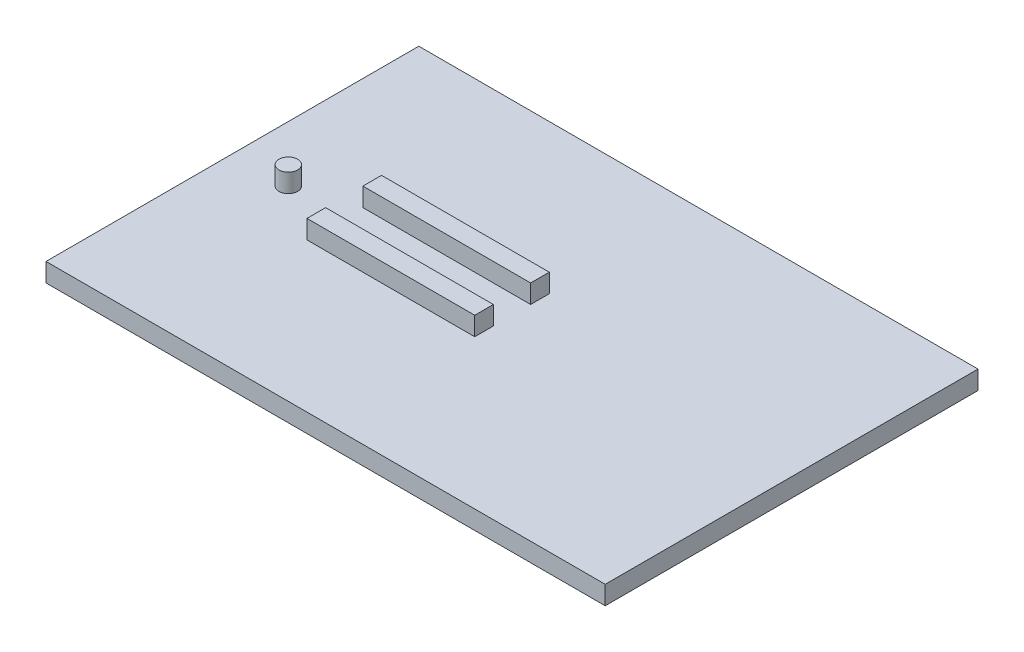
ISO-10303-21;
HEADER;
FILE_DESCRIPTION(('STEP AP214'),'2;1');
FILE_NAME('part.step','',(''),(''),'','','');
FILE_SCHEMA(('AUTOMOTIVE_DESIGN { 1 0 10303 214 1 1 1 1 }'));
ENDSEC;
DATA;
#1=APPLICATION_CONTEXT('core data for automotive mechanical design processes');
#2=APPLICATION_PROTOCOL_DEFINITION('international standard','automotive_design',2000,#1);
#3=PRODUCT_CONTEXT('',#1,'mechanical');
#4=PRODUCT('Part','Part','',(#3));
#5=PRODUCT_RELATED_PRODUCT_CATEGORY('part','',(#4));
#6=PRODUCT_DEFINITION_FORMATION('','',#4);
#7=PRODUCT_DEFINITION_CONTEXT('part definition',#1,'design');
#8=PRODUCT_DEFINITION('design','',#6,#7);
#9=PRODUCT_DEFINITION_SHAPE('','',#8);
#10=(LENGTH_UNIT() NAMED_UNIT(*) SI_UNIT(.MILLI.,.METRE.));
#11=(NAMED_UNIT(*) PLANE_ANGLE_UNIT() SI_UNIT($,.RADIAN.));
#12=(NAMED_UNIT(*) SI_UNIT($,.STERADIAN.) SOLID_ANGLE_UNIT());
#13=UNCERTAINTY_MEASURE_WITH_UNIT(LENGTH_MEASURE(1.E-05),#10,'distance_accuracy_value','');
#14=(GEOMETRIC_REPRESENTATION_CONTEXT(3) GLOBAL_UNCERTAINTY_ASSIGNED_CONTEXT((#13)) GLOBAL_UNIT_ASSIGNED_CONTEXT((#10,
#11,#12)) REPRESENTATION_CONTEXT('',''));
#15=CARTESIAN_POINT('',(0.,0.,0.));
#16=DIRECTION('',(0.,0.,1.));
#17=DIRECTION('',(1.,0.,0.));
#18=AXIS2_PLACEMENT_3D('',#15,#16,#17);
#19=CARTESIAN_POINT('',(0.,10.,0.));
#20=DIRECTION('',(0.,-1.,0.));
#21=DIRECTION('',(0.,0.,-1.));
#22=AXIS2_PLACEMENT_3D('',#19,#20,#21);
#23=PLANE('',#22);
#24=DIRECTION('',(0.,0.,1.));
#25=VECTOR('',#24,1.);
#26=CARTESIAN_POINT('',(60.,10.,-110.));
#27=LINE('',#26,#25);
#28=CARTESIAN_POINT('',(60.,10.,-120.));
#29=VERTEX_POINT('',#28);
#30=CARTESIAN_POINT('',(60.,10.,-110.));
#31=VERTEX_POINT('',#30);
#32=EDGE_CURVE('E143',#29,#31,#27,.T.);
#33=ORIENTED_EDGE('',*,*,#32,.F.);
#34=DIRECTION('',(-1.,0.,0.));
#35=VECTOR('',#34,1.);
#36=CARTESIAN_POINT('',(60.,10.,-120.));
#37=LINE('',#36,#35);
#38=CARTESIAN_POINT('',(150.,10.,-120.));
#39=VERTEX_POINT('',#38);
#40=EDGE_CURVE('E156',#39,#29,#37,.T.);
#41=ORIENTED_EDGE('',*,*,#40,.F.);
#42=DIRECTION('',(0.,0.,-1.));
#43=VECTOR('',#42,1.);
#44=CARTESIAN_POINT('',(150.,10.,-110.));
#45=LINE('',#44,#43);
#46=CARTESIAN_POINT('',(150.,10.,-110.));
#47=VERTEX_POINT('',#46);
#48=EDGE_CURVE('E165',#47,#39,#45,.T.);
#49=ORIENTED_EDGE('',*,*,#48,.F.);
#50=DIRECTION('',(1.,0.,0.));
#51=VECTOR('',#50,1.);
#52=CARTESIAN_POINT('',(60.,10.,-110.));
#53=LINE('',#52,#51);
#54=EDGE_CURVE('E146',#31,#47,#53,.T.);
#55=ORIENTED_EDGE('',*,*,#54,.F.);
#56=EDGE_LOOP('',(#33,#41,#49,#55));
#57=FACE_BOUND('',#56,.T.);
#58=DIRECTION('',(0.,0.,1.));
#59=VECTOR('',#58,1.);
#60=CARTESIAN_POINT('',(0.,10.,0.));
#61=LINE('',#60,#59);
#62=CARTESIAN_POINT('',(0.,10.,-200.));
#63=VERTEX_POINT('',#62);
#64=CARTESIAN_POINT('',(0.,10.,0.));
#65=VERTEX_POINT('',#64);
#66=EDGE_CURVE('E185',#63,#65,#61,.T.);
#67=ORIENTED_EDGE('',*,*,#66,.T.);
#68=DIRECTION('',(1.,0.,0.));
#69=VECTOR('',#68,1.);
#70=CARTESIAN_POINT('',(0.,10.,0.));
#71=LINE('',#70,#69);
#72=CARTESIAN_POINT('',(300.,10.,0.));
#73=VERTEX_POINT('',#72);
#74=EDGE_CURVE('E188',#65,#73,#71,.T.);
#75=ORIENTED_EDGE('',*,*,#74,.T.);
#76=DIRECTION('',(0.,0.,-1.));
#77=VECTOR('',#76,1.);
#78=CARTESIAN_POINT('',(300.,10.,0.));
#79=LINE('',#78,#77);
#80=CARTESIAN_POINT('',(300.,10.,-200.));
#81=VERTEX_POINT('',#80);
#82=EDGE_CURVE('E191',#73,#81,#79,.T.);
#83=ORIENTED_EDGE('',*,*,#82,.T.);
#84=DIRECTION('',(-1.,0.,0.));
#85=VECTOR('',#84,1.);
#86=CARTESIAN_POINT('',(0.,10.,-200.));
#87=LINE('',#86,#85);
#88=EDGE_CURVE('E193',#81,#63,#87,.T.);
#89=ORIENTED_EDGE('',*,*,#88,.T.);
#90=EDGE_LOOP('',(#67,#75,#83,#89));
#91=FACE_BOUND('',#90,.T.);
#92=CARTESIAN_POINT('',(30.,10.,-100.));
#93=DIRECTION('',(0.,-1.,0.));
#94=DIRECTION('',(0.,0.,-1.));
#95=AXIS2_PLACEMENT_3D('',#92,#93,#94);
#96=CIRCLE('',#95,5.00000000000001);
#97=CARTESIAN_POINT('',(30.,10.,-105.));
#98=VERTEX_POINT('',#97);
#99=EDGE_CURVE('E11',#98,#98,#96,.F.);
#100=ORIENTED_EDGE('',*,*,#99,.F.);
#101=EDGE_LOOP('',(#100));
#102=FACE_BOUND('',#101,.T.);
#103=DIRECTION('',(0.,0.,1.));
#104=VECTOR('',#103,1.);
#105=CARTESIAN_POINT('',(60.,10.,-90.));
#106=LINE('',#105,#104);
#107=CARTESIAN_POINT('',(60.,10.,-90.));
#108=VERTEX_POINT('',#107);
#109=CARTESIAN_POINT('',(60.,10.,-80.));
#110=VERTEX_POINT('',#109);
#111=EDGE_CURVE('E142',#108,#110,#106,.T.);
#112=ORIENTED_EDGE('',*,*,#111,.F.);
#113=DIRECTION('',(-1.,0.,0.));
#114=VECTOR('',#113,1.);
#115=CARTESIAN_POINT('',(60.,10.,-90.));
#116=LINE('',#115,#114);
#117=CARTESIAN_POINT('',(150.,10.,-90.));
#118=VERTEX_POINT('',#117);
#119=EDGE_CURVE('E139',#118,#108,#116,.T.);
#120=ORIENTED_EDGE('',*,*,#119,.F.);
#121=DIRECTION('',(0.,0.,-1.));
#122=VECTOR('',#121,1.);
#123=CARTESIAN_POINT('',(150.,10.,-90.));
#124=LINE('',#123,#122);
#125=CARTESIAN_POINT('',(150.,10.,-80.));
#126=VERTEX_POINT('',#125);
#127=EDGE_CURVE('E53',#126,#118,#124,.T.);
#128=ORIENTED_EDGE('',*,*,#127,.F.);
#129=DIRECTION('',(1.,0.,0.));
#130=VECTOR('',#129,1.);
#131=CARTESIAN_POINT('',(60.,10.,-80.));
#132=LINE('',#131,#130);
#133=EDGE_CURVE('E48',#110,#126,#132,.T.);
#134=ORIENTED_EDGE('',*,*,#133,.F.);
#135=EDGE_LOOP('',(#112,#120,#128,#134));
#136=FACE_BOUND('',#135,.T.);
#137=ADVANCED_FACE('F33',(#57,#91,#102,#136),#23,.F.);
#138=CARTESIAN_POINT('',(0.,10.,0.));
#139=DIRECTION('',(1.,0.,0.));
#140=DIRECTION('',(0.,0.,-1.));
#141=AXIS2_PLACEMENT_3D('',#138,#139,#140);
#142=PLANE('',#141);
#143=DIRECTION('',(0.,0.,1.));
#144=VECTOR('',#143,1.);
#145=CARTESIAN_POINT('',(0.,0.,0.));
#146=LINE('',#145,#144);
#147=CARTESIAN_POINT('',(0.,0.,-200.));
#148=VERTEX_POINT('',#147);
#149=CARTESIAN_POINT('',(0.,0.,0.));
#150=VERTEX_POINT('',#149);
#151=EDGE_CURVE('E184',#148,#150,#146,.T.);
#152=ORIENTED_EDGE('',*,*,#151,.T.);
#153=DIRECTION('',(0.,-1.,0.));
#154=VECTOR('',#153,1.);
#155=CARTESIAN_POINT('',(0.,10.,0.));
#156=LINE('',#155,#154);
#157=EDGE_CURVE('E41',#65,#150,#156,.T.);
#158=ORIENTED_EDGE('',*,*,#157,.F.);
#159=ORIENTED_EDGE('',*,*,#66,.F.);
#160=DIRECTION('',(0.,-1.,0.));
#161=VECTOR('',#160,1.);
#162=CARTESIAN_POINT('',(0.,10.,-200.));
#163=LINE('',#162,#161);
#164=EDGE_CURVE('E195',#63,#148,#163,.T.);
#165=ORIENTED_EDGE('',*,*,#164,.T.);
#166=EDGE_LOOP('',(#152,#158,#159,#165));
#167=FACE_BOUND('',#166,.T.);
#168=ADVANCED_FACE('F35',(#167),#142,.F.);
#169=CARTESIAN_POINT('',(0.,10.,0.));
#170=DIRECTION('',(0.,0.,-1.));
#171=DIRECTION('',(-1.,0.,0.));
#172=AXIS2_PLACEMENT_3D('',#169,#170,#171);
#173=PLANE('',#172);
#174=DIRECTION('',(1.,0.,0.));
#175=VECTOR('',#174,1.);
#176=CARTESIAN_POINT('',(0.,0.,0.));
#177=LINE('',#176,#175);
#178=CARTESIAN_POINT('',(300.,0.,0.));
#179=VERTEX_POINT('',#178);
#180=EDGE_CURVE('E198',#150,#179,#177,.T.);
#181=ORIENTED_EDGE('',*,*,#180,.T.);
#182=DIRECTION('',(0.,-1.,0.));
#183=VECTOR('',#182,1.);
#184=CARTESIAN_POINT('',(300.,10.,0.));
#185=LINE('',#184,#183);
#186=EDGE_CURVE('E208',#73,#179,#185,.T.);
#187=ORIENTED_EDGE('',*,*,#186,.F.);
#188=ORIENTED_EDGE('',*,*,#74,.F.);
#189=ORIENTED_EDGE('',*,*,#157,.T.);
#190=EDGE_LOOP('',(#181,#187,#188,#189));
#191=FACE_BOUND('',#190,.T.);
#192=ADVANCED_FACE('F213',(#191),#173,.F.);
#193=CARTESIAN_POINT('',(300.,10.,0.));
#194=DIRECTION('',(-1.,0.,0.));
#195=DIRECTION('',(0.,0.,1.));
#196=AXIS2_PLACEMENT_3D('',#193,#194,#195);
#197=PLANE('',#196);
#198=DIRECTION('',(0.,0.,-1.));
#199=VECTOR('',#198,1.);
#200=CARTESIAN_POINT('',(300.,0.,0.));
#201=LINE('',#200,#199);
#202=CARTESIAN_POINT('',(300.,0.,-200.));
#203=VERTEX_POINT('',#202);
#204=EDGE_CURVE('E200',#179,#203,#201,.T.);
#205=ORIENTED_EDGE('',*,*,#204,.T.);
#206=DIRECTION('',(0.,-1.,0.));
#207=VECTOR('',#206,1.);
#208=CARTESIAN_POINT('',(300.,10.,-200.));
#209=LINE('',#208,#207);
#210=EDGE_CURVE('E205',#81,#203,#209,.T.);
#211=ORIENTED_EDGE('',*,*,#210,.F.);
#212=ORIENTED_EDGE('',*,*,#82,.F.);
#213=ORIENTED_EDGE('',*,*,#186,.T.);
#214=EDGE_LOOP('',(#205,#211,#212,#213));
#215=FACE_BOUND('',#214,.T.);
#216=ADVANCED_FACE('F225',(#215),#197,.F.);
#217=CARTESIAN_POINT('',(0.,10.,-200.));
#218=DIRECTION('',(0.,0.,1.));
#219=DIRECTION('',(1.,0.,0.));
#220=AXIS2_PLACEMENT_3D('',#217,#218,#219);
#221=PLANE('',#220);
#222=DIRECTION('',(-1.,0.,0.));
#223=VECTOR('',#222,1.);
#224=CARTESIAN_POINT('',(0.,0.,-200.));
#225=LINE('',#224,#223);
#226=EDGE_CURVE('E189',#203,#148,#225,.T.);
#227=ORIENTED_EDGE('',*,*,#226,.T.);
#228=ORIENTED_EDGE('',*,*,#164,.F.);
#229=ORIENTED_EDGE('',*,*,#88,.F.);
#230=ORIENTED_EDGE('',*,*,#210,.T.);
#231=EDGE_LOOP('',(#227,#228,#229,#230));
#232=FACE_BOUND('',#231,.T.);
#233=ADVANCED_FACE('F229',(#232),#221,.F.);
#234=CARTESIAN_POINT('',(0.,0.,0.));
#235=DIRECTION('',(0.,-1.,0.));
#236=DIRECTION('',(0.,0.,-1.));
#237=AXIS2_PLACEMENT_3D('',#234,#235,#236);
#238=PLANE('',#237);
#239=ORIENTED_EDGE('',*,*,#151,.F.);
#240=ORIENTED_EDGE('',*,*,#226,.F.);
#241=ORIENTED_EDGE('',*,*,#204,.F.);
#242=ORIENTED_EDGE('',*,*,#180,.F.);
#243=EDGE_LOOP('',(#239,#240,#241,#242));
#244=FACE_BOUND('',#243,.T.);
#245=ADVANCED_FACE('F221',(#244),#238,.T.);
#246=CARTESIAN_POINT('',(30.,20.,-100.));
#247=DIRECTION('',(0.,-1.,0.));
#248=DIRECTION('',(0.,0.,-1.));
#249=AXIS2_PLACEMENT_3D('',#246,#247,#248);
#250=CYLINDRICAL_SURFACE('',#249,5.00000000000001);
#251=CARTESIAN_POINT('',(30.,20.,-100.));
#252=DIRECTION('',(0.,1.,0.));
#253=DIRECTION('',(0.,0.,1.));
#254=AXIS2_PLACEMENT_3D('',#251,#252,#253);
#255=CIRCLE('',#254,5.00000000000001);
#256=CARTESIAN_POINT('',(30.,20.,-95.));
#257=VERTEX_POINT('',#256);
#258=EDGE_CURVE('E181',#257,#257,#255,.T.);
#259=ORIENTED_EDGE('',*,*,#258,.F.);
#260=EDGE_LOOP('',(#259));
#261=FACE_BOUND('',#260,.T.);
#262=ORIENTED_EDGE('',*,*,#99,.T.);
#263=EDGE_LOOP('',(#262));
#264=FACE_BOUND('',#263,.T.);
#265=ADVANCED_FACE('F286',(#261,#264),#250,.T.);
#266=CARTESIAN_POINT('',(30.,20.,-100.));
#267=DIRECTION('',(0.,1.,0.));
#268=DIRECTION('',(0.,0.,1.));
#269=AXIS2_PLACEMENT_3D('',#266,#267,#268);
#270=PLANE('',#269);
#271=ORIENTED_EDGE('',*,*,#258,.T.);
#272=EDGE_LOOP('',(#271));
#273=FACE_BOUND('',#272,.T.);
#274=ADVANCED_FACE('F282',(#273),#270,.T.);
#275=CARTESIAN_POINT('',(60.,20.,-110.));
#276=DIRECTION('',(1.,0.,0.));
#277=DIRECTION('',(0.,0.,-1.));
#278=AXIS2_PLACEMENT_3D('',#275,#276,#277);
#279=PLANE('',#278);
#280=ORIENTED_EDGE('',*,*,#32,.T.);
#281=DIRECTION('',(0.,-1.,0.));
#282=VECTOR('',#281,1.);
#283=CARTESIAN_POINT('',(60.,20.,-110.));
#284=LINE('',#283,#282);
#285=CARTESIAN_POINT('',(60.,20.,-110.));
#286=VERTEX_POINT('',#285);
#287=EDGE_CURVE('E178',#286,#31,#284,.T.);
#288=ORIENTED_EDGE('',*,*,#287,.F.);
#289=DIRECTION('',(0.,0.,1.));
#290=VECTOR('',#289,1.);
#291=CARTESIAN_POINT('',(60.,20.,-110.));
#292=LINE('',#291,#290);
#293=CARTESIAN_POINT('',(60.,20.,-120.));
#294=VERTEX_POINT('',#293);
#295=EDGE_CURVE('E152',#294,#286,#292,.T.);
#296=ORIENTED_EDGE('',*,*,#295,.F.);
#297=DIRECTION('',(0.,-1.,0.));
#298=VECTOR('',#297,1.);
#299=CARTESIAN_POINT('',(60.,20.,-120.));
#300=LINE('',#299,#298);
#301=EDGE_CURVE('E161',#294,#29,#300,.T.);
#302=ORIENTED_EDGE('',*,*,#301,.T.);
#303=EDGE_LOOP('',(#280,#288,#296,#302));
#304=FACE_BOUND('',#303,.T.);
#305=ADVANCED_FACE('F278',(#304),#279,.F.);
#306=CARTESIAN_POINT('',(60.,20.,-110.));
#307=DIRECTION('',(0.,0.,-1.));
#308=DIRECTION('',(-1.,0.,0.));
#309=AXIS2_PLACEMENT_3D('',#306,#307,#308);
#310=PLANE('',#309);
#311=ORIENTED_EDGE('',*,*,#54,.T.);
#312=DIRECTION('',(0.,-1.,0.));
#313=VECTOR('',#312,1.);
#314=CARTESIAN_POINT('',(150.,20.,-110.));
#315=LINE('',#314,#313);
#316=CARTESIAN_POINT('',(150.,20.,-110.));
#317=VERTEX_POINT('',#316);
#318=EDGE_CURVE('E175',#317,#47,#315,.T.);
#319=ORIENTED_EDGE('',*,*,#318,.F.);
#320=DIRECTION('',(1.,0.,0.));
#321=VECTOR('',#320,1.);
#322=CARTESIAN_POINT('',(60.,20.,-110.));
#323=LINE('',#322,#321);
#324=EDGE_CURVE('E155',#286,#317,#323,.T.);
#325=ORIENTED_EDGE('',*,*,#324,.F.);
#326=ORIENTED_EDGE('',*,*,#287,.T.);
#327=EDGE_LOOP('',(#311,#319,#325,#326));
#328=FACE_BOUND('',#327,.T.);
#329=ADVANCED_FACE('F274',(#328),#310,.F.);
#330=CARTESIAN_POINT('',(150.,20.,-110.));
#331=DIRECTION('',(-1.,0.,0.));
#332=DIRECTION('',(0.,0.,1.));
#333=AXIS2_PLACEMENT_3D('',#330,#331,#332);
#334=PLANE('',#333);
#335=ORIENTED_EDGE('',*,*,#48,.T.);
#336=DIRECTION('',(0.,-1.,0.));
#337=VECTOR('',#336,1.);
#338=CARTESIAN_POINT('',(150.,20.,-120.));
#339=LINE('',#338,#337);
#340=CARTESIAN_POINT('',(150.,20.,-120.));
#341=VERTEX_POINT('',#340);
#342=EDGE_CURVE('E172',#341,#39,#339,.T.);
#343=ORIENTED_EDGE('',*,*,#342,.F.);
#344=DIRECTION('',(0.,0.,-1.));
#345=VECTOR('',#344,1.);
#346=CARTESIAN_POINT('',(150.,20.,-110.));
#347=LINE('',#346,#345);
#348=EDGE_CURVE('E158',#317,#341,#347,.T.);
#349=ORIENTED_EDGE('',*,*,#348,.F.);
#350=ORIENTED_EDGE('',*,*,#318,.T.);
#351=EDGE_LOOP('',(#335,#343,#349,#350));
#352=FACE_BOUND('',#351,.T.);
#353=ADVANCED_FACE('F270',(#352),#334,.F.);
#354=CARTESIAN_POINT('',(60.,20.,-120.));
#355=DIRECTION('',(0.,0.,1.));
#356=DIRECTION('',(1.,0.,0.));
#357=AXIS2_PLACEMENT_3D('',#354,#355,#356);
#358=PLANE('',#357);
#359=ORIENTED_EDGE('',*,*,#40,.T.);
#360=ORIENTED_EDGE('',*,*,#301,.F.);
#361=DIRECTION('',(-1.,0.,0.));
#362=VECTOR('',#361,1.);
#363=CARTESIAN_POINT('',(60.,20.,-120.));
#364=LINE('',#363,#362);
#365=EDGE_CURVE('E160',#341,#294,#364,.T.);
#366=ORIENTED_EDGE('',*,*,#365,.F.);
#367=ORIENTED_EDGE('',*,*,#342,.T.);
#368=EDGE_LOOP('',(#359,#360,#366,#367));
#369=FACE_BOUND('',#368,.T.);
#370=ADVANCED_FACE('F266',(#369),#358,.F.);
#371=CARTESIAN_POINT('',(0.,20.,0.));
#372=DIRECTION('',(0.,-1.,0.));
#373=DIRECTION('',(0.,0.,-1.));
#374=AXIS2_PLACEMENT_3D('',#371,#372,#373);
#375=PLANE('',#374);
#376=ORIENTED_EDGE('',*,*,#295,.T.);
#377=ORIENTED_EDGE('',*,*,#324,.T.);
#378=ORIENTED_EDGE('',*,*,#348,.T.);
#379=ORIENTED_EDGE('',*,*,#365,.T.);
#380=EDGE_LOOP('',(#376,#377,#378,#379));
#381=FACE_BOUND('',#380,.T.);
#382=ADVANCED_FACE('F263',(#381),#375,.F.);
#383=CARTESIAN_POINT('',(60.,20.,-90.));
#384=DIRECTION('',(1.,0.,0.));
#385=DIRECTION('',(0.,0.,-1.));
#386=AXIS2_PLACEMENT_3D('',#383,#384,#385);
#387=PLANE('',#386);
#388=ORIENTED_EDGE('',*,*,#111,.T.);
#389=DIRECTION('',(0.,-1.,0.));
#390=VECTOR('',#389,1.);
#391=CARTESIAN_POINT('',(60.,20.,-80.));
#392=LINE('',#391,#390);
#393=CARTESIAN_POINT('',(60.,20.,-80.));
#394=VERTEX_POINT('',#393);
#395=EDGE_CURVE('E123',#394,#110,#392,.T.);
#396=ORIENTED_EDGE('',*,*,#395,.F.);
#397=DIRECTION('',(0.,0.,1.));
#398=VECTOR('',#397,1.);
#399=CARTESIAN_POINT('',(60.,20.,-90.));
#400=LINE('',#399,#398);
#401=CARTESIAN_POINT('',(60.,20.,-90.));
#402=VERTEX_POINT('',#401);
#403=EDGE_CURVE('E130',#402,#394,#400,.T.);
#404=ORIENTED_EDGE('',*,*,#403,.F.);
#405=DIRECTION('',(0.,-1.,0.));
#406=VECTOR('',#405,1.);
#407=CARTESIAN_POINT('',(60.,20.,-90.));
#408=LINE('',#407,#406);
#409=EDGE_CURVE('E241',#402,#108,#408,.T.);
#410=ORIENTED_EDGE('',*,*,#409,.T.);
#411=EDGE_LOOP('',(#388,#396,#404,#410));
#412=FACE_BOUND('',#411,.T.);
#413=ADVANCED_FACE('F141',(#412),#387,.F.);
#414=CARTESIAN_POINT('',(60.,20.,-80.));
#415=DIRECTION('',(0.,0.,-1.));
#416=DIRECTION('',(-1.,0.,0.));
#417=AXIS2_PLACEMENT_3D('',#414,#415,#416);
#418=PLANE('',#417);
#419=ORIENTED_EDGE('',*,*,#133,.T.);
#420=DIRECTION('',(0.,-1.,0.));
#421=VECTOR('',#420,1.);
#422=CARTESIAN_POINT('',(150.,20.,-80.));
#423=LINE('',#422,#421);
#424=CARTESIAN_POINT('',(150.,20.,-80.));
#425=VERTEX_POINT('',#424);
#426=EDGE_CURVE('E126',#425,#126,#423,.T.);
#427=ORIENTED_EDGE('',*,*,#426,.F.);
#428=DIRECTION('',(1.,0.,0.));
#429=VECTOR('',#428,1.);
#430=CARTESIAN_POINT('',(60.,20.,-80.));
#431=LINE('',#430,#429);
#432=EDGE_CURVE('E119',#394,#425,#431,.T.);
#433=ORIENTED_EDGE('',*,*,#432,.F.);
#434=ORIENTED_EDGE('',*,*,#395,.T.);
#435=EDGE_LOOP('',(#419,#427,#433,#434));
#436=FACE_BOUND('',#435,.T.);
#437=ADVANCED_FACE('F121',(#436),#418,.F.);
#438=CARTESIAN_POINT('',(150.,20.,-90.));
#439=DIRECTION('',(-1.,0.,0.));
#440=DIRECTION('',(0.,0.,1.));
#441=AXIS2_PLACEMENT_3D('',#438,#439,#440);
#442=PLANE('',#441);
#443=ORIENTED_EDGE('',*,*,#127,.T.);
#444=DIRECTION('',(0.,-1.,0.));
#445=VECTOR('',#444,1.);
#446=CARTESIAN_POINT('',(150.,20.,-90.));
#447=LINE('',#446,#445);
#448=CARTESIAN_POINT('',(150.,20.,-90.));
#449=VERTEX_POINT('',#448);
#450=EDGE_CURVE('E148',#449,#118,#447,.T.);
#451=ORIENTED_EDGE('',*,*,#450,.F.);
#452=DIRECTION('',(0.,0.,-1.));
#453=VECTOR('',#452,1.);
#454=CARTESIAN_POINT('',(150.,20.,-90.));
#455=LINE('',#454,#453);
#456=EDGE_CURVE('E129',#425,#449,#455,.T.);
#457=ORIENTED_EDGE('',*,*,#456,.F.);
#458=ORIENTED_EDGE('',*,*,#426,.T.);
#459=EDGE_LOOP('',(#443,#451,#457,#458));
#460=FACE_BOUND('',#459,.T.);
#461=ADVANCED_FACE('F250',(#460),#442,.F.);
#462=CARTESIAN_POINT('',(60.,20.,-90.));
#463=DIRECTION('',(0.,0.,1.));
#464=DIRECTION('',(1.,0.,0.));
#465=AXIS2_PLACEMENT_3D('',#462,#463,#464);
#466=PLANE('',#465);
#467=ORIENTED_EDGE('',*,*,#119,.T.);
#468=ORIENTED_EDGE('',*,*,#409,.F.);
#469=DIRECTION('',(-1.,0.,0.));
#470=VECTOR('',#469,1.);
#471=CARTESIAN_POINT('',(60.,20.,-90.));
#472=LINE('',#471,#470);
#473=EDGE_CURVE('E135',#449,#402,#472,.T.);
#474=ORIENTED_EDGE('',*,*,#473,.F.);
#475=ORIENTED_EDGE('',*,*,#450,.T.);
#476=EDGE_LOOP('',(#467,#468,#474,#475));
#477=FACE_BOUND('',#476,.T.);
#478=ADVANCED_FACE('F240',(#477),#466,.F.);
#479=CARTESIAN_POINT('',(0.,20.,0.));
#480=DIRECTION('',(0.,1.,0.));
#481=DIRECTION('',(0.,0.,1.));
#482=AXIS2_PLACEMENT_3D('',#479,#480,#481);
#483=PLANE('',#482);
#484=ORIENTED_EDGE('',*,*,#403,.T.);
#485=ORIENTED_EDGE('',*,*,#432,.T.);
#486=ORIENTED_EDGE('',*,*,#456,.T.);
#487=ORIENTED_EDGE('',*,*,#473,.T.);
#488=EDGE_LOOP('',(#484,#485,#486,#487));
#489=FACE_BOUND('',#488,.T.);
#490=ADVANCED_FACE('F133',(#489),#483,.T.);
#491=CLOSED_SHELL('',(#137,#168,#192,#216,#233,#245,#265,#274,#305,#329,#353,#370,#382,#413,
#437,#461,#478,#490));
#492=MANIFOLD_SOLID_BREP('B2',#491);
#493=ADVANCED_BREP_SHAPE_REPRESENTATION('',(#18,#492),#14);
#494=SHAPE_DEFINITION_REPRESENTATION(#9,#493);
ENDSEC;
END-ISO-10303-21;
